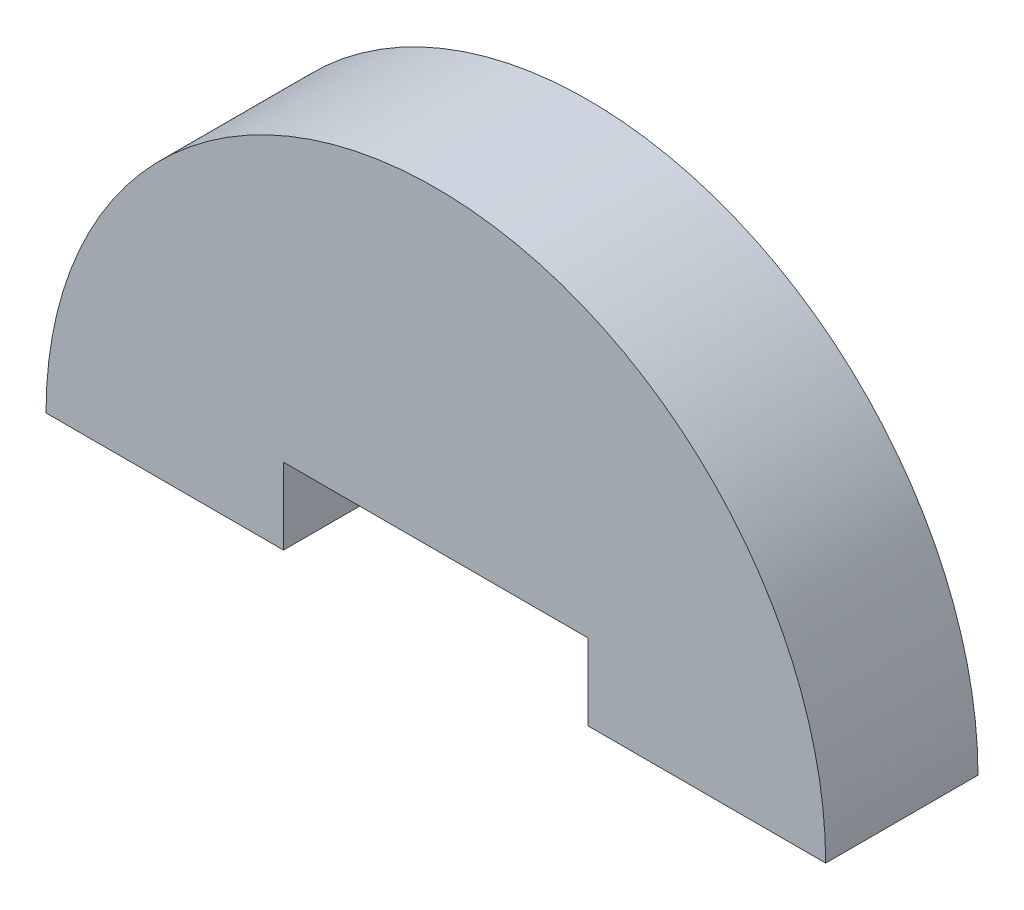
ISO-10303-21;
HEADER;
FILE_DESCRIPTION(('STEP AP214'),'2;1');
FILE_NAME('part.step','',(''),(''),'','','');
FILE_SCHEMA(('AUTOMOTIVE_DESIGN { 1 0 10303 214 1 1 1 1 }'));
ENDSEC;
DATA;
#1=APPLICATION_CONTEXT('core data for automotive mechanical design processes');
#2=APPLICATION_PROTOCOL_DEFINITION('international standard','automotive_design',2000,#1);
#3=PRODUCT_CONTEXT('',#1,'mechanical');
#4=PRODUCT('Part','Part','',(#3));
#5=PRODUCT_RELATED_PRODUCT_CATEGORY('part','',(#4));
#6=PRODUCT_DEFINITION_FORMATION('','',#4);
#7=PRODUCT_DEFINITION_CONTEXT('part definition',#1,'design');
#8=PRODUCT_DEFINITION('design','',#6,#7);
#9=PRODUCT_DEFINITION_SHAPE('','',#8);
#10=(LENGTH_UNIT() NAMED_UNIT(*) SI_UNIT(.MILLI.,.METRE.));
#11=(NAMED_UNIT(*) PLANE_ANGLE_UNIT() SI_UNIT($,.RADIAN.));
#12=(NAMED_UNIT(*) SI_UNIT($,.STERADIAN.) SOLID_ANGLE_UNIT());
#13=UNCERTAINTY_MEASURE_WITH_UNIT(LENGTH_MEASURE(1.E-05),#10,'distance_accuracy_value','');
#14=(GEOMETRIC_REPRESENTATION_CONTEXT(3) GLOBAL_UNCERTAINTY_ASSIGNED_CONTEXT((#13)) GLOBAL_UNIT_ASSIGNED_CONTEXT((#10,
#11,#12)) REPRESENTATION_CONTEXT('',''));
#15=CARTESIAN_POINT('',(0.,0.,0.));
#16=DIRECTION('',(0.,0.,1.));
#17=DIRECTION('',(1.,0.,0.));
#18=AXIS2_PLACEMENT_3D('',#15,#16,#17);
#19=CARTESIAN_POINT('',(3516.86558593584,1300.54639368179,6.));
#20=DIRECTION('',(0.,1.,0.));
#21=DIRECTION('',(0.,0.,1.));
#22=AXIS2_PLACEMENT_3D('',#19,#20,#21);
#23=PLANE('',#22);
#24=DIRECTION('',(1.,0.,0.));
#25=VECTOR('',#24,1.);
#26=CARTESIAN_POINT('',(3516.86558593584,1300.54639368179,0.));
#27=LINE('',#26,#25);
#28=CARTESIAN_POINT('',(3516.86558593584,1300.54639368179,0.));
#29=VERTEX_POINT('',#28);
#30=CARTESIAN_POINT('',(3526.22272879299,1300.54639368179,0.));
#31=VERTEX_POINT('',#30);
#32=EDGE_CURVE('E129',#29,#31,#27,.T.);
#33=ORIENTED_EDGE('',*,*,#32,.T.);
#34=DIRECTION('',(0.,0.,-1.));
#35=VECTOR('',#34,1.);
#36=CARTESIAN_POINT('',(3526.22272879299,1300.54639368179,6.));
#37=LINE('',#36,#35);
#38=CARTESIAN_POINT('',(3526.22272879299,1300.54639368179,6.));
#39=VERTEX_POINT('',#38);
#40=EDGE_CURVE('E11',#39,#31,#37,.T.);
#41=ORIENTED_EDGE('',*,*,#40,.F.);
#42=DIRECTION('',(1.,0.,0.));
#43=VECTOR('',#42,1.);
#44=CARTESIAN_POINT('',(3516.86558593584,1300.54639368179,6.));
#45=LINE('',#44,#43);
#46=CARTESIAN_POINT('',(3516.86558593584,1300.54639368179,6.));
#47=VERTEX_POINT('',#46);
#48=EDGE_CURVE('E146',#47,#39,#45,.T.);
#49=ORIENTED_EDGE('',*,*,#48,.F.);
#50=DIRECTION('',(0.,0.,-1.));
#51=VECTOR('',#50,1.);
#52=CARTESIAN_POINT('',(3516.86558593584,1300.54639368179,6.));
#53=LINE('',#52,#51);
#54=EDGE_CURVE('E128',#47,#29,#53,.T.);
#55=ORIENTED_EDGE('',*,*,#54,.T.);
#56=EDGE_LOOP('',(#33,#41,#49,#55));
#57=FACE_BOUND('',#56,.T.);
#58=ADVANCED_FACE('F39',(#57),#23,.F.);
#59=CARTESIAN_POINT('',(3510.86558593584,1300.54639368179,6.));
#60=DIRECTION('',(0.,0.,-1.));
#61=DIRECTION('',(-1.,0.,0.));
#62=AXIS2_PLACEMENT_3D('',#59,#60,#61);
#63=CYLINDRICAL_SURFACE('',#62,15.3571428571442);
#64=CARTESIAN_POINT('',(3510.86558593584,1300.54639368179,0.));
#65=DIRECTION('',(0.,0.,1.));
#66=DIRECTION('',(1.,0.,0.));
#67=AXIS2_PLACEMENT_3D('',#64,#65,#66);
#68=CIRCLE('',#67,15.3571428571442);
#69=CARTESIAN_POINT('',(3495.5084430787,1300.54639368179,0.));
#70=VERTEX_POINT('',#69);
#71=EDGE_CURVE('E133',#31,#70,#68,.T.);
#72=ORIENTED_EDGE('',*,*,#71,.T.);
#73=DIRECTION('',(0.,0.,-1.));
#74=VECTOR('',#73,1.);
#75=CARTESIAN_POINT('',(3495.5084430787,1300.54639368179,6.));
#76=LINE('',#75,#74);
#77=CARTESIAN_POINT('',(3495.5084430787,1300.54639368179,6.));
#78=VERTEX_POINT('',#77);
#79=EDGE_CURVE('E48',#78,#70,#76,.T.);
#80=ORIENTED_EDGE('',*,*,#79,.F.);
#81=CARTESIAN_POINT('',(3510.86558593584,1300.54639368179,6.));
#82=DIRECTION('',(0.,0.,1.));
#83=DIRECTION('',(1.,0.,0.));
#84=AXIS2_PLACEMENT_3D('',#81,#82,#83);
#85=CIRCLE('',#84,15.3571428571442);
#86=EDGE_CURVE('E92',#39,#78,#85,.T.);
#87=ORIENTED_EDGE('',*,*,#86,.F.);
#88=ORIENTED_EDGE('',*,*,#40,.T.);
#89=EDGE_LOOP('',(#72,#80,#87,#88));
#90=FACE_BOUND('',#89,.T.);
#91=ADVANCED_FACE('F174',(#90),#63,.T.);
#92=CARTESIAN_POINT('',(3495.5084430787,1300.54639368179,6.));
#93=DIRECTION('',(0.,1.,0.));
#94=DIRECTION('',(0.,0.,1.));
#95=AXIS2_PLACEMENT_3D('',#92,#93,#94);
#96=PLANE('',#95);
#97=DIRECTION('',(1.,0.,0.));
#98=VECTOR('',#97,1.);
#99=CARTESIAN_POINT('',(3495.5084430787,1300.54639368179,0.));
#100=LINE('',#99,#98);
#101=CARTESIAN_POINT('',(3504.86558593584,1300.54639368179,0.));
#102=VERTEX_POINT('',#101);
#103=EDGE_CURVE('E136',#70,#102,#100,.T.);
#104=ORIENTED_EDGE('',*,*,#103,.T.);
#105=DIRECTION('',(0.,0.,-1.));
#106=VECTOR('',#105,1.);
#107=CARTESIAN_POINT('',(3504.86558593584,1300.54639368179,6.));
#108=LINE('',#107,#106);
#109=CARTESIAN_POINT('',(3504.86558593584,1300.54639368179,6.));
#110=VERTEX_POINT('',#109);
#111=EDGE_CURVE('E109',#110,#102,#108,.T.);
#112=ORIENTED_EDGE('',*,*,#111,.F.);
#113=DIRECTION('',(1.,0.,0.));
#114=VECTOR('',#113,1.);
#115=CARTESIAN_POINT('',(3495.5084430787,1300.54639368179,6.));
#116=LINE('',#115,#114);
#117=EDGE_CURVE('E118',#78,#110,#116,.T.);
#118=ORIENTED_EDGE('',*,*,#117,.F.);
#119=ORIENTED_EDGE('',*,*,#79,.T.);
#120=EDGE_LOOP('',(#104,#112,#118,#119));
#121=FACE_BOUND('',#120,.T.);
#122=ADVANCED_FACE('F156',(#121),#96,.F.);
#123=CARTESIAN_POINT('',(3504.86558593584,1303.54639368179,6.));
#124=DIRECTION('',(1.,0.,0.));
#125=DIRECTION('',(0.,0.,-1.));
#126=AXIS2_PLACEMENT_3D('',#123,#124,#125);
#127=PLANE('',#126);
#128=DIRECTION('',(0.,-1.,0.));
#129=VECTOR('',#128,1.);
#130=CARTESIAN_POINT('',(3504.86558593584,1303.54639368179,0.));
#131=LINE('',#130,#129);
#132=CARTESIAN_POINT('',(3504.86558593584,1303.54639368179,0.));
#133=VERTEX_POINT('',#132);
#134=EDGE_CURVE('E107',#133,#102,#131,.T.);
#135=ORIENTED_EDGE('',*,*,#134,.F.);
#136=DIRECTION('',(0.,0.,-1.));
#137=VECTOR('',#136,1.);
#138=CARTESIAN_POINT('',(3504.86558593584,1303.54639368179,6.));
#139=LINE('',#138,#137);
#140=CARTESIAN_POINT('',(3504.86558593584,1303.54639368179,6.));
#141=VERTEX_POINT('',#140);
#142=EDGE_CURVE('E101',#141,#133,#139,.T.);
#143=ORIENTED_EDGE('',*,*,#142,.F.);
#144=DIRECTION('',(0.,-1.,0.));
#145=VECTOR('',#144,1.);
#146=CARTESIAN_POINT('',(3504.86558593584,1303.54639368179,6.));
#147=LINE('',#146,#145);
#148=EDGE_CURVE('E105',#141,#110,#147,.T.);
#149=ORIENTED_EDGE('',*,*,#148,.T.);
#150=ORIENTED_EDGE('',*,*,#111,.T.);
#151=EDGE_LOOP('',(#135,#143,#149,#150));
#152=FACE_BOUND('',#151,.T.);
#153=ADVANCED_FACE('F103',(#152),#127,.T.);
#154=CARTESIAN_POINT('',(3504.86558593584,1303.54639368179,6.));
#155=DIRECTION('',(0.,1.,0.));
#156=DIRECTION('',(0.,0.,1.));
#157=AXIS2_PLACEMENT_3D('',#154,#155,#156);
#158=PLANE('',#157);
#159=DIRECTION('',(1.,0.,0.));
#160=VECTOR('',#159,1.);
#161=CARTESIAN_POINT('',(3504.86558593584,1303.54639368179,0.));
#162=LINE('',#161,#160);
#163=CARTESIAN_POINT('',(3516.86558593584,1303.54639368179,0.));
#164=VERTEX_POINT('',#163);
#165=EDGE_CURVE('E78',#133,#164,#162,.T.);
#166=ORIENTED_EDGE('',*,*,#165,.T.);
#167=DIRECTION('',(0.,0.,-1.));
#168=VECTOR('',#167,1.);
#169=CARTESIAN_POINT('',(3516.86558593584,1303.54639368179,6.));
#170=LINE('',#169,#168);
#171=CARTESIAN_POINT('',(3516.86558593584,1303.54639368179,6.));
#172=VERTEX_POINT('',#171);
#173=EDGE_CURVE('E110',#172,#164,#170,.T.);
#174=ORIENTED_EDGE('',*,*,#173,.F.);
#175=DIRECTION('',(1.,0.,0.));
#176=VECTOR('',#175,1.);
#177=CARTESIAN_POINT('',(3504.86558593584,1303.54639368179,6.));
#178=LINE('',#177,#176);
#179=EDGE_CURVE('E112',#141,#172,#178,.T.);
#180=ORIENTED_EDGE('',*,*,#179,.F.);
#181=ORIENTED_EDGE('',*,*,#142,.T.);
#182=EDGE_LOOP('',(#166,#174,#180,#181));
#183=FACE_BOUND('',#182,.T.);
#184=ADVANCED_FACE('F113',(#183),#158,.F.);
#185=CARTESIAN_POINT('',(3516.86558593584,1303.54639368179,6.));
#186=DIRECTION('',(1.,0.,0.));
#187=DIRECTION('',(0.,0.,-1.));
#188=AXIS2_PLACEMENT_3D('',#185,#186,#187);
#189=PLANE('',#188);
#190=DIRECTION('',(0.,-1.,0.));
#191=VECTOR('',#190,1.);
#192=CARTESIAN_POINT('',(3516.86558593584,1303.54639368179,0.));
#193=LINE('',#192,#191);
#194=EDGE_CURVE('E84',#164,#29,#193,.T.);
#195=ORIENTED_EDGE('',*,*,#194,.T.);
#196=ORIENTED_EDGE('',*,*,#54,.F.);
#197=DIRECTION('',(0.,-1.,0.));
#198=VECTOR('',#197,1.);
#199=CARTESIAN_POINT('',(3516.86558593584,1303.54639368179,6.));
#200=LINE('',#199,#198);
#201=EDGE_CURVE('E56',#172,#47,#200,.T.);
#202=ORIENTED_EDGE('',*,*,#201,.F.);
#203=ORIENTED_EDGE('',*,*,#173,.T.);
#204=EDGE_LOOP('',(#195,#196,#202,#203));
#205=FACE_BOUND('',#204,.T.);
#206=ADVANCED_FACE('F163',(#205),#189,.F.);
#207=CARTESIAN_POINT('',(3510.86558593584,1300.54639368179,6.));
#208=DIRECTION('',(0.,0.,1.));
#209=DIRECTION('',(1.,0.,0.));
#210=AXIS2_PLACEMENT_3D('',#207,#208,#209);
#211=PLANE('',#210);
#212=ORIENTED_EDGE('',*,*,#48,.T.);
#213=ORIENTED_EDGE('',*,*,#86,.T.);
#214=ORIENTED_EDGE('',*,*,#117,.T.);
#215=ORIENTED_EDGE('',*,*,#148,.F.);
#216=ORIENTED_EDGE('',*,*,#179,.T.);
#217=ORIENTED_EDGE('',*,*,#201,.T.);
#218=EDGE_LOOP('',(#212,#213,#214,#215,#216,#217));
#219=FACE_BOUND('',#218,.T.);
#220=ADVANCED_FACE('F116',(#219),#211,.T.);
#221=CARTESIAN_POINT('',(3510.86558593584,1300.54639368179,0.));
#222=DIRECTION('',(0.,0.,1.));
#223=DIRECTION('',(1.,0.,0.));
#224=AXIS2_PLACEMENT_3D('',#221,#222,#223);
#225=PLANE('',#224);
#226=ORIENTED_EDGE('',*,*,#32,.F.);
#227=ORIENTED_EDGE('',*,*,#194,.F.);
#228=ORIENTED_EDGE('',*,*,#165,.F.);
#229=ORIENTED_EDGE('',*,*,#134,.T.);
#230=ORIENTED_EDGE('',*,*,#103,.F.);
#231=ORIENTED_EDGE('',*,*,#71,.F.);
#232=EDGE_LOOP('',(#226,#227,#228,#229,#230,#231));
#233=FACE_BOUND('',#232,.T.);
#234=ADVANCED_FACE('F159',(#233),#225,.F.);
#235=CLOSED_SHELL('',(#58,#91,#122,#153,#184,#206,#220,#234));
#236=MANIFOLD_SOLID_BREP('B2',#235);
#237=ADVANCED_BREP_SHAPE_REPRESENTATION('',(#18,#236),#14);
#238=SHAPE_DEFINITION_REPRESENTATION(#9,#237);
ENDSEC;
END-ISO-10303-21;
